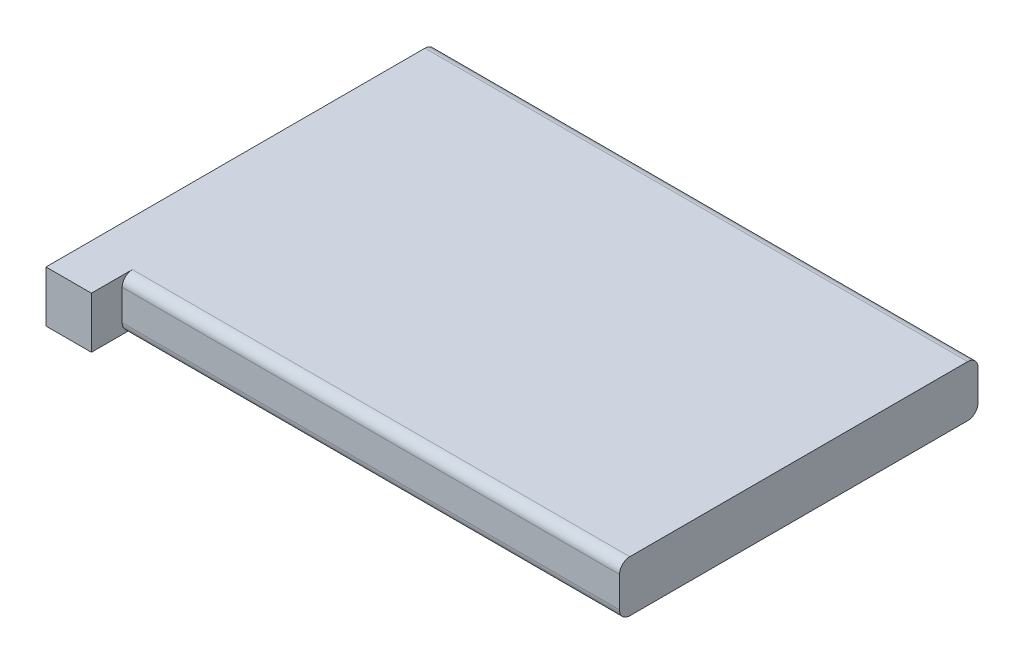
ISO-10303-21;
HEADER;
FILE_DESCRIPTION(('STEP AP214'),'2;1');
FILE_NAME('part.step','',(''),(''),'','','');
FILE_SCHEMA(('AUTOMOTIVE_DESIGN { 1 0 10303 214 1 1 1 1 }'));
ENDSEC;
DATA;
#1=APPLICATION_CONTEXT('core data for automotive mechanical design processes');
#2=APPLICATION_PROTOCOL_DEFINITION('international standard','automotive_design',2000,#1);
#3=PRODUCT_CONTEXT('',#1,'mechanical');
#4=PRODUCT('Part','Part','',(#3));
#5=PRODUCT_RELATED_PRODUCT_CATEGORY('part','',(#4));
#6=PRODUCT_DEFINITION_FORMATION('','',#4);
#7=PRODUCT_DEFINITION_CONTEXT('part definition',#1,'design');
#8=PRODUCT_DEFINITION('design','',#6,#7);
#9=PRODUCT_DEFINITION_SHAPE('','',#8);
#10=(LENGTH_UNIT() NAMED_UNIT(*) SI_UNIT(.MILLI.,.METRE.));
#11=(NAMED_UNIT(*) PLANE_ANGLE_UNIT() SI_UNIT($,.RADIAN.));
#12=(NAMED_UNIT(*) SI_UNIT($,.STERADIAN.) SOLID_ANGLE_UNIT());
#13=UNCERTAINTY_MEASURE_WITH_UNIT(LENGTH_MEASURE(1.E-05),#10,'distance_accuracy_value','');
#14=(GEOMETRIC_REPRESENTATION_CONTEXT(3) GLOBAL_UNCERTAINTY_ASSIGNED_CONTEXT((#13)) GLOBAL_UNIT_ASSIGNED_CONTEXT((#10,
#11,#12)) REPRESENTATION_CONTEXT('',''));
#15=CARTESIAN_POINT('',(0.,0.,0.));
#16=DIRECTION('',(0.,0.,1.));
#17=DIRECTION('',(1.,0.,0.));
#18=AXIS2_PLACEMENT_3D('',#15,#16,#17);
#19=CARTESIAN_POINT('',(26.5,5.,17.5));
#20=DIRECTION('',(-1.,0.,0.));
#21=DIRECTION('',(0.,0.,1.));
#22=AXIS2_PLACEMENT_3D('',#19,#20,#21);
#23=PLANE('',#22);
#24=DIRECTION('',(0.,0.,-1.));
#25=VECTOR('',#24,1.);
#26=CARTESIAN_POINT('',(26.5,0.,17.5));
#27=LINE('',#26,#25);
#28=CARTESIAN_POINT('',(26.5,0.,16.5));
#29=VERTEX_POINT('',#28);
#30=CARTESIAN_POINT('',(26.5,0.,-16.5));
#31=VERTEX_POINT('',#30);
#32=EDGE_CURVE('E121',#29,#31,#27,.T.);
#33=ORIENTED_EDGE('',*,*,#32,.T.);
#34=CARTESIAN_POINT('',(26.5,1.,-16.5));
#35=DIRECTION('',(-1.,0.,0.));
#36=DIRECTION('',(0.,0.,1.));
#37=AXIS2_PLACEMENT_3D('',#34,#35,#36);
#38=CIRCLE('',#37,1.);
#39=CARTESIAN_POINT('',(26.5,1.,-17.5));
#40=VERTEX_POINT('',#39);
#41=EDGE_CURVE('E178',#31,#40,#38,.F.);
#42=ORIENTED_EDGE('',*,*,#41,.T.);
#43=DIRECTION('',(0.,-1.,0.));
#44=VECTOR('',#43,1.);
#45=CARTESIAN_POINT('',(26.5,5.,-17.5));
#46=LINE('',#45,#44);
#47=CARTESIAN_POINT('',(26.5,4.,-17.5));
#48=VERTEX_POINT('',#47);
#49=EDGE_CURVE('E157',#48,#40,#46,.T.);
#50=ORIENTED_EDGE('',*,*,#49,.F.);
#51=CARTESIAN_POINT('',(26.5,4.,-16.5));
#52=DIRECTION('',(-1.,0.,0.));
#53=DIRECTION('',(0.,0.,1.));
#54=AXIS2_PLACEMENT_3D('',#51,#52,#53);
#55=CIRCLE('',#54,1.);
#56=CARTESIAN_POINT('',(26.5,5.,-16.5));
#57=VERTEX_POINT('',#56);
#58=EDGE_CURVE('E176',#48,#57,#55,.F.);
#59=ORIENTED_EDGE('',*,*,#58,.T.);
#60=DIRECTION('',(0.,0.,-1.));
#61=VECTOR('',#60,1.);
#62=CARTESIAN_POINT('',(26.5,5.,17.5));
#63=LINE('',#62,#61);
#64=CARTESIAN_POINT('',(26.5,5.,16.5));
#65=VERTEX_POINT('',#64);
#66=EDGE_CURVE('E120',#65,#57,#63,.T.);
#67=ORIENTED_EDGE('',*,*,#66,.F.);
#68=CARTESIAN_POINT('',(26.5,4.,16.5));
#69=DIRECTION('',(-1.,0.,0.));
#70=DIRECTION('',(0.,0.,1.));
#71=AXIS2_PLACEMENT_3D('',#68,#69,#70);
#72=CIRCLE('',#71,1.);
#73=CARTESIAN_POINT('',(26.5,4.,17.5));
#74=VERTEX_POINT('',#73);
#75=EDGE_CURVE('E172',#65,#74,#72,.F.);
#76=ORIENTED_EDGE('',*,*,#75,.T.);
#77=DIRECTION('',(0.,-1.,0.));
#78=VECTOR('',#77,1.);
#79=CARTESIAN_POINT('',(26.5,5.,17.5));
#80=LINE('',#79,#78);
#81=CARTESIAN_POINT('',(26.5,1.,17.5));
#82=VERTEX_POINT('',#81);
#83=EDGE_CURVE('E150',#74,#82,#80,.T.);
#84=ORIENTED_EDGE('',*,*,#83,.T.);
#85=CARTESIAN_POINT('',(26.5,1.,16.5));
#86=DIRECTION('',(-1.,0.,0.));
#87=DIRECTION('',(0.,0.,1.));
#88=AXIS2_PLACEMENT_3D('',#85,#86,#87);
#89=CIRCLE('',#88,1.);
#90=EDGE_CURVE('E174',#82,#29,#89,.F.);
#91=ORIENTED_EDGE('',*,*,#90,.T.);
#92=EDGE_LOOP('',(#33,#42,#50,#59,#67,#76,#84,#91));
#93=FACE_BOUND('',#92,.T.);
#94=ADVANCED_FACE('F31',(#93),#23,.F.);
#95=CARTESIAN_POINT('',(-26.5,5.,-17.5));
#96=DIRECTION('',(0.,0.,1.));
#97=DIRECTION('',(1.,0.,0.));
#98=AXIS2_PLACEMENT_3D('',#95,#96,#97);
#99=PLANE('',#98);
#100=ORIENTED_EDGE('',*,*,#49,.T.);
#101=DIRECTION('',(-1.,0.,0.));
#102=VECTOR('',#101,1.);
#103=CARTESIAN_POINT('',(-26.5,1.,-17.5));
#104=LINE('',#103,#102);
#105=CARTESIAN_POINT('',(-26.5,1.,-17.5));
#106=VERTEX_POINT('',#105);
#107=EDGE_CURVE('E162',#40,#106,#104,.T.);
#108=ORIENTED_EDGE('',*,*,#107,.T.);
#109=DIRECTION('',(0.,-1.,0.));
#110=VECTOR('',#109,1.);
#111=CARTESIAN_POINT('',(-26.5,5.,-17.5));
#112=LINE('',#111,#110);
#113=CARTESIAN_POINT('',(-26.5,4.,-17.5));
#114=VERTEX_POINT('',#113);
#115=EDGE_CURVE('E155',#114,#106,#112,.T.);
#116=ORIENTED_EDGE('',*,*,#115,.F.);
#117=DIRECTION('',(-1.,0.,0.));
#118=VECTOR('',#117,1.);
#119=CARTESIAN_POINT('',(-26.5,4.,-17.5));
#120=LINE('',#119,#118);
#121=EDGE_CURVE('E160',#114,#48,#120,.F.);
#122=ORIENTED_EDGE('',*,*,#121,.T.);
#123=EDGE_LOOP('',(#100,#108,#116,#122));
#124=FACE_BOUND('',#123,.T.);
#125=ADVANCED_FACE('F206',(#124),#99,.F.);
#126=CARTESIAN_POINT('',(-26.5,5.,17.5));
#127=DIRECTION('',(1.,0.,0.));
#128=DIRECTION('',(0.,0.,-1.));
#129=AXIS2_PLACEMENT_3D('',#126,#127,#128);
#130=PLANE('',#129);
#131=DIRECTION('',(0.,-1.,0.));
#132=VECTOR('',#131,1.);
#133=CARTESIAN_POINT('',(-26.5,5.,20.5));
#134=LINE('',#133,#132);
#135=CARTESIAN_POINT('',(-26.5,5.,20.5));
#136=VERTEX_POINT('',#135);
#137=CARTESIAN_POINT('',(-26.5,0.,20.5));
#138=VERTEX_POINT('',#137);
#139=EDGE_CURVE('E115',#136,#138,#134,.T.);
#140=ORIENTED_EDGE('',*,*,#139,.F.);
#141=DIRECTION('',(0.,0.,1.));
#142=VECTOR('',#141,1.);
#143=CARTESIAN_POINT('',(-26.5,5.,17.5));
#144=LINE('',#143,#142);
#145=CARTESIAN_POINT('',(-26.5,5.,-16.5));
#146=VERTEX_POINT('',#145);
#147=EDGE_CURVE('E148',#146,#136,#144,.T.);
#148=ORIENTED_EDGE('',*,*,#147,.F.);
#149=CARTESIAN_POINT('',(-26.5,4.,-16.5));
#150=DIRECTION('',(1.,0.,0.));
#151=DIRECTION('',(0.,0.,-1.));
#152=AXIS2_PLACEMENT_3D('',#149,#150,#151);
#153=CIRCLE('',#152,1.);
#154=EDGE_CURVE('E165',#146,#114,#153,.F.);
#155=ORIENTED_EDGE('',*,*,#154,.T.);
#156=ORIENTED_EDGE('',*,*,#115,.T.);
#157=CARTESIAN_POINT('',(-26.5,1.,-16.5));
#158=DIRECTION('',(1.,0.,0.));
#159=DIRECTION('',(0.,0.,-1.));
#160=AXIS2_PLACEMENT_3D('',#157,#158,#159);
#161=CIRCLE('',#160,1.);
#162=CARTESIAN_POINT('',(-26.5,0.,-16.5));
#163=VERTEX_POINT('',#162);
#164=EDGE_CURVE('E117',#106,#163,#161,.F.);
#165=ORIENTED_EDGE('',*,*,#164,.T.);
#166=DIRECTION('',(0.,0.,1.));
#167=VECTOR('',#166,1.);
#168=CARTESIAN_POINT('',(-26.5,0.,17.5));
#169=LINE('',#168,#167);
#170=EDGE_CURVE('E110',#163,#138,#169,.T.);
#171=ORIENTED_EDGE('',*,*,#170,.T.);
#172=EDGE_LOOP('',(#140,#148,#155,#156,#165,#171));
#173=FACE_BOUND('',#172,.T.);
#174=ADVANCED_FACE('F112',(#173),#130,.F.);
#175=CARTESIAN_POINT('',(-26.5,5.,17.5));
#176=DIRECTION('',(0.,0.,-1.));
#177=DIRECTION('',(-1.,0.,0.));
#178=AXIS2_PLACEMENT_3D('',#175,#176,#177);
#179=PLANE('',#178);
#180=DIRECTION('',(1.,0.,0.));
#181=VECTOR('',#180,1.);
#182=CARTESIAN_POINT('',(-26.5,4.,17.5));
#183=LINE('',#182,#181);
#184=CARTESIAN_POINT('',(-22.0641189175716,4.,17.5));
#185=VERTEX_POINT('',#184);
#186=EDGE_CURVE('E185',#74,#185,#183,.F.);
#187=ORIENTED_EDGE('',*,*,#186,.T.);
#188=DIRECTION('',(0.,-1.,0.));
#189=VECTOR('',#188,1.);
#190=CARTESIAN_POINT('',(-22.0641189175716,5.,17.5));
#191=LINE('',#190,#189);
#192=CARTESIAN_POINT('',(-22.0641189175716,1.,17.5));
#193=VERTEX_POINT('',#192);
#194=EDGE_CURVE('E46',#185,#193,#191,.T.);
#195=ORIENTED_EDGE('',*,*,#194,.T.);
#196=DIRECTION('',(1.,0.,0.));
#197=VECTOR('',#196,1.);
#198=CARTESIAN_POINT('',(26.5,1.,17.5));
#199=LINE('',#198,#197);
#200=EDGE_CURVE('E39',#193,#82,#199,.T.);
#201=ORIENTED_EDGE('',*,*,#200,.T.);
#202=ORIENTED_EDGE('',*,*,#83,.F.);
#203=EDGE_LOOP('',(#187,#195,#201,#202));
#204=FACE_BOUND('',#203,.T.);
#205=ADVANCED_FACE('F188',(#204),#179,.F.);
#206=CARTESIAN_POINT('',(0.,5.,0.));
#207=DIRECTION('',(0.,-1.,0.));
#208=DIRECTION('',(0.,0.,-1.));
#209=AXIS2_PLACEMENT_3D('',#206,#207,#208);
#210=PLANE('',#209);
#211=DIRECTION('',(0.,0.,1.));
#212=VECTOR('',#211,1.);
#213=CARTESIAN_POINT('',(-22.0641189175716,5.,13.));
#214=LINE('',#213,#212);
#215=CARTESIAN_POINT('',(-22.0641189175716,5.,16.5));
#216=VERTEX_POINT('',#215);
#217=CARTESIAN_POINT('',(-22.0641189175716,5.,20.5));
#218=VERTEX_POINT('',#217);
#219=EDGE_CURVE('E141',#216,#218,#214,.T.);
#220=ORIENTED_EDGE('',*,*,#219,.F.);
#221=DIRECTION('',(1.,0.,0.));
#222=VECTOR('',#221,1.);
#223=CARTESIAN_POINT('',(0.,5.,16.5));
#224=LINE('',#223,#222);
#225=EDGE_CURVE('E180',#216,#65,#224,.T.);
#226=ORIENTED_EDGE('',*,*,#225,.T.);
#227=ORIENTED_EDGE('',*,*,#66,.T.);
#228=DIRECTION('',(-1.,0.,0.));
#229=VECTOR('',#228,1.);
#230=CARTESIAN_POINT('',(0.,5.,-16.5));
#231=LINE('',#230,#229);
#232=EDGE_CURVE('E182',#57,#146,#231,.T.);
#233=ORIENTED_EDGE('',*,*,#232,.T.);
#234=ORIENTED_EDGE('',*,*,#147,.T.);
#235=DIRECTION('',(-1.,0.,0.));
#236=VECTOR('',#235,1.);
#237=CARTESIAN_POINT('',(-26.5,5.,20.5));
#238=LINE('',#237,#236);
#239=EDGE_CURVE('E136',#218,#136,#238,.T.);
#240=ORIENTED_EDGE('',*,*,#239,.F.);
#241=EDGE_LOOP('',(#220,#226,#227,#233,#234,#240));
#242=FACE_BOUND('',#241,.T.);
#243=ADVANCED_FACE('F200',(#242),#210,.F.);
#244=CARTESIAN_POINT('',(0.,0.,0.));
#245=DIRECTION('',(0.,-1.,0.));
#246=DIRECTION('',(0.,0.,-1.));
#247=AXIS2_PLACEMENT_3D('',#244,#245,#246);
#248=PLANE('',#247);
#249=DIRECTION('',(1.,0.,0.));
#250=VECTOR('',#249,1.);
#251=CARTESIAN_POINT('',(-26.5,0.,16.5));
#252=LINE('',#251,#250);
#253=CARTESIAN_POINT('',(-22.0641189175716,0.,16.5));
#254=VERTEX_POINT('',#253);
#255=EDGE_CURVE('E168',#29,#254,#252,.F.);
#256=ORIENTED_EDGE('',*,*,#255,.T.);
#257=DIRECTION('',(0.,0.,1.));
#258=VECTOR('',#257,1.);
#259=CARTESIAN_POINT('',(-22.0641189175716,0.,13.));
#260=LINE('',#259,#258);
#261=CARTESIAN_POINT('',(-22.0641189175716,0.,20.5));
#262=VERTEX_POINT('',#261);
#263=EDGE_CURVE('E127',#254,#262,#260,.T.);
#264=ORIENTED_EDGE('',*,*,#263,.T.);
#265=DIRECTION('',(1.,0.,0.));
#266=VECTOR('',#265,1.);
#267=CARTESIAN_POINT('',(-26.5,0.,20.5));
#268=LINE('',#267,#266);
#269=EDGE_CURVE('E124',#138,#262,#268,.T.);
#270=ORIENTED_EDGE('',*,*,#269,.F.);
#271=ORIENTED_EDGE('',*,*,#170,.F.);
#272=DIRECTION('',(-1.,0.,0.));
#273=VECTOR('',#272,1.);
#274=CARTESIAN_POINT('',(26.5,0.,-16.5));
#275=LINE('',#274,#273);
#276=EDGE_CURVE('E170',#163,#31,#275,.F.);
#277=ORIENTED_EDGE('',*,*,#276,.T.);
#278=ORIENTED_EDGE('',*,*,#32,.F.);
#279=EDGE_LOOP('',(#256,#264,#270,#271,#277,#278));
#280=FACE_BOUND('',#279,.T.);
#281=ADVANCED_FACE('F125',(#280),#248,.T.);
#282=CARTESIAN_POINT('',(-26.5,1.,-16.5));
#283=DIRECTION('',(1.,0.,0.));
#284=DIRECTION('',(0.,0.,-1.));
#285=AXIS2_PLACEMENT_3D('',#282,#283,#284);
#286=CYLINDRICAL_SURFACE('',#285,1.);
#287=ORIENTED_EDGE('',*,*,#41,.F.);
#288=ORIENTED_EDGE('',*,*,#276,.F.);
#289=ORIENTED_EDGE('',*,*,#164,.F.);
#290=ORIENTED_EDGE('',*,*,#107,.F.);
#291=EDGE_LOOP('',(#287,#288,#289,#290));
#292=FACE_BOUND('',#291,.T.);
#293=ADVANCED_FACE('F213',(#292),#286,.T.);
#294=CARTESIAN_POINT('',(0.,4.,-16.5));
#295=DIRECTION('',(-1.,0.,0.));
#296=DIRECTION('',(0.,0.,1.));
#297=AXIS2_PLACEMENT_3D('',#294,#295,#296);
#298=CYLINDRICAL_SURFACE('',#297,1.);
#299=ORIENTED_EDGE('',*,*,#58,.F.);
#300=ORIENTED_EDGE('',*,*,#121,.F.);
#301=ORIENTED_EDGE('',*,*,#154,.F.);
#302=ORIENTED_EDGE('',*,*,#232,.F.);
#303=EDGE_LOOP('',(#299,#300,#301,#302));
#304=FACE_BOUND('',#303,.T.);
#305=ADVANCED_FACE('F210',(#304),#298,.T.);
#306=CARTESIAN_POINT('',(-26.5,1.,16.5));
#307=DIRECTION('',(-1.,0.,0.));
#308=DIRECTION('',(0.,0.,1.));
#309=AXIS2_PLACEMENT_3D('',#306,#307,#308);
#310=CYLINDRICAL_SURFACE('',#309,1.);
#311=CARTESIAN_POINT('',(-22.0641189175716,1.,16.5));
#312=DIRECTION('',(1.,0.,0.));
#313=DIRECTION('',(0.,0.,-1.));
#314=AXIS2_PLACEMENT_3D('',#311,#312,#313);
#315=CIRCLE('',#314,1.);
#316=EDGE_CURVE('E53',#254,#193,#315,.F.);
#317=ORIENTED_EDGE('',*,*,#316,.F.);
#318=ORIENTED_EDGE('',*,*,#255,.F.);
#319=ORIENTED_EDGE('',*,*,#90,.F.);
#320=ORIENTED_EDGE('',*,*,#200,.F.);
#321=EDGE_LOOP('',(#317,#318,#319,#320));
#322=FACE_BOUND('',#321,.T.);
#323=ADVANCED_FACE('F190',(#322),#310,.T.);
#324=CARTESIAN_POINT('',(0.,4.,16.5));
#325=DIRECTION('',(1.,0.,0.));
#326=DIRECTION('',(0.,0.,-1.));
#327=AXIS2_PLACEMENT_3D('',#324,#325,#326);
#328=CYLINDRICAL_SURFACE('',#327,1.);
#329=CARTESIAN_POINT('',(-22.0641189175716,4.,16.5));
#330=DIRECTION('',(1.,0.,0.));
#331=DIRECTION('',(0.,0.,-1.));
#332=AXIS2_PLACEMENT_3D('',#329,#330,#331);
#333=CIRCLE('',#332,1.);
#334=EDGE_CURVE('E11',#185,#216,#333,.F.);
#335=ORIENTED_EDGE('',*,*,#334,.F.);
#336=ORIENTED_EDGE('',*,*,#186,.F.);
#337=ORIENTED_EDGE('',*,*,#75,.F.);
#338=ORIENTED_EDGE('',*,*,#225,.F.);
#339=EDGE_LOOP('',(#335,#336,#337,#338));
#340=FACE_BOUND('',#339,.T.);
#341=ADVANCED_FACE('F33',(#340),#328,.T.);
#342=CARTESIAN_POINT('',(-22.0641189175716,5.,13.));
#343=DIRECTION('',(1.,0.,0.));
#344=DIRECTION('',(0.,0.,-1.));
#345=AXIS2_PLACEMENT_3D('',#342,#343,#344);
#346=PLANE('',#345);
#347=ORIENTED_EDGE('',*,*,#263,.F.);
#348=ORIENTED_EDGE('',*,*,#316,.T.);
#349=ORIENTED_EDGE('',*,*,#194,.F.);
#350=ORIENTED_EDGE('',*,*,#334,.T.);
#351=ORIENTED_EDGE('',*,*,#219,.T.);
#352=DIRECTION('',(0.,1.,0.));
#353=VECTOR('',#352,1.);
#354=CARTESIAN_POINT('',(-22.0641189175716,5.,20.5));
#355=LINE('',#354,#353);
#356=EDGE_CURVE('E131',#262,#218,#355,.T.);
#357=ORIENTED_EDGE('',*,*,#356,.F.);
#358=EDGE_LOOP('',(#347,#348,#349,#350,#351,#357));
#359=FACE_BOUND('',#358,.T.);
#360=ADVANCED_FACE('F197',(#359),#346,.T.);
#361=CARTESIAN_POINT('',(0.,0.,20.5));
#362=DIRECTION('',(0.,0.,1.));
#363=DIRECTION('',(1.,0.,0.));
#364=AXIS2_PLACEMENT_3D('',#361,#362,#363);
#365=PLANE('',#364);
#366=ORIENTED_EDGE('',*,*,#139,.T.);
#367=ORIENTED_EDGE('',*,*,#269,.T.);
#368=ORIENTED_EDGE('',*,*,#356,.T.);
#369=ORIENTED_EDGE('',*,*,#239,.T.);
#370=EDGE_LOOP('',(#366,#367,#368,#369));
#371=FACE_BOUND('',#370,.T.);
#372=ADVANCED_FACE('F134',(#371),#365,.T.);
#373=CLOSED_SHELL('',(#94,#125,#174,#205,#243,#281,#293,#305,#323,#341,#360,#372));
#374=MANIFOLD_SOLID_BREP('B2',#373);
#375=ADVANCED_BREP_SHAPE_REPRESENTATION('',(#18,#374),#14);
#376=SHAPE_DEFINITION_REPRESENTATION(#9,#375);
ENDSEC;
END-ISO-10303-21;
